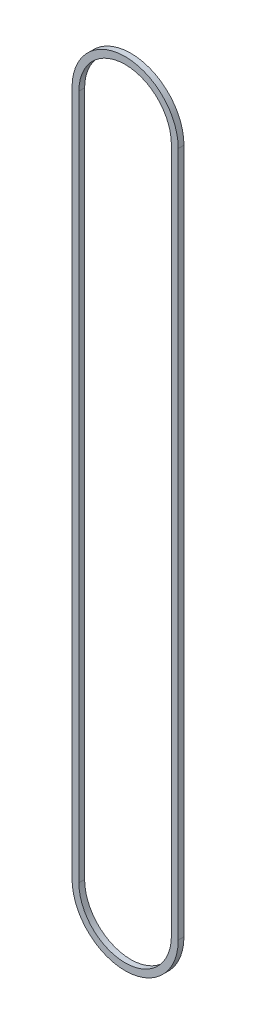
ISO-10303-21;
HEADER;
FILE_DESCRIPTION(('STEP AP214'),'2;1');
FILE_NAME('part.step','',(''),(''),'','','');
FILE_SCHEMA(('AUTOMOTIVE_DESIGN { 1 0 10303 214 1 1 1 1 }'));
ENDSEC;
DATA;
#1=APPLICATION_CONTEXT('core data for automotive mechanical design processes');
#2=APPLICATION_PROTOCOL_DEFINITION('international standard','automotive_design',2000,#1);
#3=PRODUCT_CONTEXT('',#1,'mechanical');
#4=PRODUCT('Part','Part','',(#3));
#5=PRODUCT_RELATED_PRODUCT_CATEGORY('part','',(#4));
#6=PRODUCT_DEFINITION_FORMATION('','',#4);
#7=PRODUCT_DEFINITION_CONTEXT('part definition',#1,'design');
#8=PRODUCT_DEFINITION('design','',#6,#7);
#9=PRODUCT_DEFINITION_SHAPE('','',#8);
#10=(LENGTH_UNIT() NAMED_UNIT(*) SI_UNIT(.MILLI.,.METRE.));
#11=(NAMED_UNIT(*) PLANE_ANGLE_UNIT() SI_UNIT($,.RADIAN.));
#12=(NAMED_UNIT(*) SI_UNIT($,.STERADIAN.) SOLID_ANGLE_UNIT());
#13=UNCERTAINTY_MEASURE_WITH_UNIT(LENGTH_MEASURE(1.E-05),#10,'distance_accuracy_value','');
#14=(GEOMETRIC_REPRESENTATION_CONTEXT(3) GLOBAL_UNCERTAINTY_ASSIGNED_CONTEXT((#13)) GLOBAL_UNIT_ASSIGNED_CONTEXT((#10,
#11,#12)) REPRESENTATION_CONTEXT('',''));
#15=CARTESIAN_POINT('',(0.,0.,0.));
#16=DIRECTION('',(0.,0.,1.));
#17=DIRECTION('',(1.,0.,0.));
#18=AXIS2_PLACEMENT_3D('',#15,#16,#17);
#19=CARTESIAN_POINT('',(0.,0.,6.35));
#20=DIRECTION('',(0.,0.,1.));
#21=DIRECTION('',(1.,0.,0.));
#22=AXIS2_PLACEMENT_3D('',#19,#20,#21);
#23=PLANE('',#22);
#24=CARTESIAN_POINT('',(0.,0.,6.35));
#25=DIRECTION('',(0.,0.,1.));
#26=DIRECTION('',(1.,0.,0.));
#27=AXIS2_PLACEMENT_3D('',#24,#25,#26);
#28=CIRCLE('',#27,59.0169);
#29=CARTESIAN_POINT('',(-59.0169,0.,6.35));
#30=VERTEX_POINT('',#29);
#31=CARTESIAN_POINT('',(59.0169,0.,6.35));
#32=VERTEX_POINT('',#31);
#33=EDGE_CURVE('E159',#30,#32,#28,.T.);
#34=ORIENTED_EDGE('',*,*,#33,.T.);
#35=DIRECTION('',(0.,1.,0.));
#36=VECTOR('',#35,1.);
#37=CARTESIAN_POINT('',(59.0169,0.,6.35));
#38=LINE('',#37,#36);
#39=CARTESIAN_POINT('',(59.0169,762.,6.35));
#40=VERTEX_POINT('',#39);
#41=EDGE_CURVE('E163',#32,#40,#38,.T.);
#42=ORIENTED_EDGE('',*,*,#41,.T.);
#43=CARTESIAN_POINT('',(0.,762.,6.35));
#44=DIRECTION('',(0.,0.,1.));
#45=DIRECTION('',(1.,0.,0.));
#46=AXIS2_PLACEMENT_3D('',#43,#44,#45);
#47=CIRCLE('',#46,59.0169);
#48=CARTESIAN_POINT('',(-59.0169,762.,6.35));
#49=VERTEX_POINT('',#48);
#50=EDGE_CURVE('E167',#40,#49,#47,.T.);
#51=ORIENTED_EDGE('',*,*,#50,.T.);
#52=DIRECTION('',(0.,-1.,0.));
#53=VECTOR('',#52,1.);
#54=CARTESIAN_POINT('',(-59.0169,0.,6.35));
#55=LINE('',#54,#53);
#56=EDGE_CURVE('E170',#49,#30,#55,.T.);
#57=ORIENTED_EDGE('',*,*,#56,.T.);
#58=EDGE_LOOP('',(#34,#42,#51,#57));
#59=FACE_BOUND('',#58,.T.);
#60=DIRECTION('',(0.,1.,0.));
#61=VECTOR('',#60,1.);
#62=CARTESIAN_POINT('',(51.3969,0.,6.35));
#63=LINE('',#62,#61);
#64=CARTESIAN_POINT('',(51.3969,0.,6.35));
#65=VERTEX_POINT('',#64);
#66=CARTESIAN_POINT('',(51.3969,762.,6.35));
#67=VERTEX_POINT('',#66);
#68=EDGE_CURVE('E120',#65,#67,#63,.T.);
#69=ORIENTED_EDGE('',*,*,#68,.F.);
#70=CARTESIAN_POINT('',(0.,0.,6.35));
#71=DIRECTION('',(0.,0.,1.));
#72=DIRECTION('',(1.,0.,0.));
#73=AXIS2_PLACEMENT_3D('',#70,#71,#72);
#74=CIRCLE('',#73,51.3969);
#75=CARTESIAN_POINT('',(-51.3969,0.,6.35));
#76=VERTEX_POINT('',#75);
#77=EDGE_CURVE('E111',#76,#65,#74,.T.);
#78=ORIENTED_EDGE('',*,*,#77,.F.);
#79=DIRECTION('',(0.,-1.,0.));
#80=VECTOR('',#79,1.);
#81=CARTESIAN_POINT('',(-51.3969,0.,6.35));
#82=LINE('',#81,#80);
#83=CARTESIAN_POINT('',(-51.3969,762.,6.35));
#84=VERTEX_POINT('',#83);
#85=EDGE_CURVE('E137',#84,#76,#82,.T.);
#86=ORIENTED_EDGE('',*,*,#85,.F.);
#87=CARTESIAN_POINT('',(0.,762.,6.35));
#88=DIRECTION('',(0.,0.,1.));
#89=DIRECTION('',(1.,0.,0.));
#90=AXIS2_PLACEMENT_3D('',#87,#88,#89);
#91=CIRCLE('',#90,51.3969);
#92=EDGE_CURVE('E133',#67,#84,#91,.T.);
#93=ORIENTED_EDGE('',*,*,#92,.F.);
#94=EDGE_LOOP('',(#69,#78,#86,#93));
#95=FACE_BOUND('',#94,.T.);
#96=ADVANCED_FACE('F45',(#59,#95),#23,.T.);
#97=CARTESIAN_POINT('',(0.,0.,0.));
#98=DIRECTION('',(0.,0.,1.));
#99=DIRECTION('',(1.,0.,0.));
#100=AXIS2_PLACEMENT_3D('',#97,#98,#99);
#101=PLANE('',#100);
#102=CARTESIAN_POINT('',(0.,0.,0.));
#103=DIRECTION('',(0.,0.,1.));
#104=DIRECTION('',(1.,0.,0.));
#105=AXIS2_PLACEMENT_3D('',#102,#103,#104);
#106=CIRCLE('',#105,59.0169);
#107=CARTESIAN_POINT('',(-59.0169,0.,0.));
#108=VERTEX_POINT('',#107);
#109=CARTESIAN_POINT('',(59.0169,0.,0.));
#110=VERTEX_POINT('',#109);
#111=EDGE_CURVE('E129',#108,#110,#106,.T.);
#112=ORIENTED_EDGE('',*,*,#111,.F.);
#113=DIRECTION('',(0.,-1.,0.));
#114=VECTOR('',#113,1.);
#115=CARTESIAN_POINT('',(-59.0169,0.,0.));
#116=LINE('',#115,#114);
#117=CARTESIAN_POINT('',(-59.0169,762.,0.));
#118=VERTEX_POINT('',#117);
#119=EDGE_CURVE('E164',#118,#108,#116,.T.);
#120=ORIENTED_EDGE('',*,*,#119,.F.);
#121=CARTESIAN_POINT('',(0.,762.,0.));
#122=DIRECTION('',(0.,0.,1.));
#123=DIRECTION('',(1.,0.,0.));
#124=AXIS2_PLACEMENT_3D('',#121,#122,#123);
#125=CIRCLE('',#124,59.0169);
#126=CARTESIAN_POINT('',(59.0169,762.,0.));
#127=VERTEX_POINT('',#126);
#128=EDGE_CURVE('E180',#127,#118,#125,.T.);
#129=ORIENTED_EDGE('',*,*,#128,.F.);
#130=DIRECTION('',(0.,1.,0.));
#131=VECTOR('',#130,1.);
#132=CARTESIAN_POINT('',(59.0169,0.,0.));
#133=LINE('',#132,#131);
#134=EDGE_CURVE('E177',#110,#127,#133,.T.);
#135=ORIENTED_EDGE('',*,*,#134,.F.);
#136=EDGE_LOOP('',(#112,#120,#129,#135));
#137=FACE_BOUND('',#136,.T.);
#138=CARTESIAN_POINT('',(0.,0.,0.));
#139=DIRECTION('',(0.,0.,1.));
#140=DIRECTION('',(1.,0.,0.));
#141=AXIS2_PLACEMENT_3D('',#138,#139,#140);
#142=CIRCLE('',#141,51.3969);
#143=CARTESIAN_POINT('',(-51.3969,0.,0.));
#144=VERTEX_POINT('',#143);
#145=CARTESIAN_POINT('',(51.3969,0.,0.));
#146=VERTEX_POINT('',#145);
#147=EDGE_CURVE('E69',#144,#146,#142,.T.);
#148=ORIENTED_EDGE('',*,*,#147,.T.);
#149=DIRECTION('',(0.,1.,0.));
#150=VECTOR('',#149,1.);
#151=CARTESIAN_POINT('',(51.3969,0.,0.));
#152=LINE('',#151,#150);
#153=CARTESIAN_POINT('',(51.3969,762.,0.));
#154=VERTEX_POINT('',#153);
#155=EDGE_CURVE('E127',#146,#154,#152,.T.);
#156=ORIENTED_EDGE('',*,*,#155,.T.);
#157=CARTESIAN_POINT('',(0.,762.,0.));
#158=DIRECTION('',(0.,0.,1.));
#159=DIRECTION('',(1.,0.,0.));
#160=AXIS2_PLACEMENT_3D('',#157,#158,#159);
#161=CIRCLE('',#160,51.3969);
#162=CARTESIAN_POINT('',(-51.3969,762.,0.));
#163=VERTEX_POINT('',#162);
#164=EDGE_CURVE('E146',#154,#163,#161,.T.);
#165=ORIENTED_EDGE('',*,*,#164,.T.);
#166=DIRECTION('',(0.,-1.,0.));
#167=VECTOR('',#166,1.);
#168=CARTESIAN_POINT('',(-51.3969,0.,0.));
#169=LINE('',#168,#167);
#170=EDGE_CURVE('E121',#163,#144,#169,.T.);
#171=ORIENTED_EDGE('',*,*,#170,.T.);
#172=EDGE_LOOP('',(#148,#156,#165,#171));
#173=FACE_BOUND('',#172,.T.);
#174=ADVANCED_FACE('F203',(#137,#173),#101,.F.);
#175=CARTESIAN_POINT('',(0.,0.,6.35));
#176=DIRECTION('',(0.,0.,-1.));
#177=DIRECTION('',(-1.,0.,0.));
#178=AXIS2_PLACEMENT_3D('',#175,#176,#177);
#179=CYLINDRICAL_SURFACE('',#178,59.0169);
#180=ORIENTED_EDGE('',*,*,#111,.T.);
#181=DIRECTION('',(0.,0.,-1.));
#182=VECTOR('',#181,1.);
#183=CARTESIAN_POINT('',(59.0169,0.,6.35));
#184=LINE('',#183,#182);
#185=EDGE_CURVE('E11',#32,#110,#184,.T.);
#186=ORIENTED_EDGE('',*,*,#185,.F.);
#187=ORIENTED_EDGE('',*,*,#33,.F.);
#188=DIRECTION('',(0.,0.,-1.));
#189=VECTOR('',#188,1.);
#190=CARTESIAN_POINT('',(-59.0169,0.,6.35));
#191=LINE('',#190,#189);
#192=EDGE_CURVE('E173',#30,#108,#191,.T.);
#193=ORIENTED_EDGE('',*,*,#192,.T.);
#194=EDGE_LOOP('',(#180,#186,#187,#193));
#195=FACE_BOUND('',#194,.T.);
#196=ADVANCED_FACE('F47',(#195),#179,.T.);
#197=CARTESIAN_POINT('',(59.0169,0.,6.35));
#198=DIRECTION('',(-1.,0.,0.));
#199=DIRECTION('',(0.,0.,1.));
#200=AXIS2_PLACEMENT_3D('',#197,#198,#199);
#201=PLANE('',#200);
#202=ORIENTED_EDGE('',*,*,#134,.T.);
#203=DIRECTION('',(0.,0.,-1.));
#204=VECTOR('',#203,1.);
#205=CARTESIAN_POINT('',(59.0169,762.,6.35));
#206=LINE('',#205,#204);
#207=EDGE_CURVE('E54',#40,#127,#206,.T.);
#208=ORIENTED_EDGE('',*,*,#207,.F.);
#209=ORIENTED_EDGE('',*,*,#41,.F.);
#210=ORIENTED_EDGE('',*,*,#185,.T.);
#211=EDGE_LOOP('',(#202,#208,#209,#210));
#212=FACE_BOUND('',#211,.T.);
#213=ADVANCED_FACE('F213',(#212),#201,.F.);
#214=CARTESIAN_POINT('',(0.,762.,6.35));
#215=DIRECTION('',(0.,0.,-1.));
#216=DIRECTION('',(-1.,0.,0.));
#217=AXIS2_PLACEMENT_3D('',#214,#215,#216);
#218=CYLINDRICAL_SURFACE('',#217,59.0169);
#219=ORIENTED_EDGE('',*,*,#128,.T.);
#220=DIRECTION('',(0.,0.,-1.));
#221=VECTOR('',#220,1.);
#222=CARTESIAN_POINT('',(-59.0169,762.,6.35));
#223=LINE('',#222,#221);
#224=EDGE_CURVE('E188',#49,#118,#223,.T.);
#225=ORIENTED_EDGE('',*,*,#224,.F.);
#226=ORIENTED_EDGE('',*,*,#50,.F.);
#227=ORIENTED_EDGE('',*,*,#207,.T.);
#228=EDGE_LOOP('',(#219,#225,#226,#227));
#229=FACE_BOUND('',#228,.T.);
#230=ADVANCED_FACE('F197',(#229),#218,.T.);
#231=CARTESIAN_POINT('',(-59.0169,0.,6.35));
#232=DIRECTION('',(1.,0.,0.));
#233=DIRECTION('',(0.,0.,-1.));
#234=AXIS2_PLACEMENT_3D('',#231,#232,#233);
#235=PLANE('',#234);
#236=ORIENTED_EDGE('',*,*,#119,.T.);
#237=ORIENTED_EDGE('',*,*,#192,.F.);
#238=ORIENTED_EDGE('',*,*,#56,.F.);
#239=ORIENTED_EDGE('',*,*,#224,.T.);
#240=EDGE_LOOP('',(#236,#237,#238,#239));
#241=FACE_BOUND('',#240,.T.);
#242=ADVANCED_FACE('F207',(#241),#235,.F.);
#243=CARTESIAN_POINT('',(0.,0.,6.35));
#244=DIRECTION('',(0.,0.,-1.));
#245=DIRECTION('',(-1.,0.,0.));
#246=AXIS2_PLACEMENT_3D('',#243,#244,#245);
#247=CYLINDRICAL_SURFACE('',#246,51.3969);
#248=ORIENTED_EDGE('',*,*,#147,.F.);
#249=DIRECTION('',(0.,0.,-1.));
#250=VECTOR('',#249,1.);
#251=CARTESIAN_POINT('',(-51.3969,0.,6.35));
#252=LINE('',#251,#250);
#253=EDGE_CURVE('E115',#76,#144,#252,.T.);
#254=ORIENTED_EDGE('',*,*,#253,.F.);
#255=ORIENTED_EDGE('',*,*,#77,.T.);
#256=DIRECTION('',(0.,0.,-1.));
#257=VECTOR('',#256,1.);
#258=CARTESIAN_POINT('',(51.3969,0.,6.35));
#259=LINE('',#258,#257);
#260=EDGE_CURVE('E114',#65,#146,#259,.T.);
#261=ORIENTED_EDGE('',*,*,#260,.T.);
#262=EDGE_LOOP('',(#248,#254,#255,#261));
#263=FACE_BOUND('',#262,.T.);
#264=ADVANCED_FACE('F113',(#263),#247,.F.);
#265=CARTESIAN_POINT('',(51.3969,0.,6.35));
#266=DIRECTION('',(-1.,0.,0.));
#267=DIRECTION('',(0.,0.,1.));
#268=AXIS2_PLACEMENT_3D('',#265,#266,#267);
#269=PLANE('',#268);
#270=ORIENTED_EDGE('',*,*,#155,.F.);
#271=ORIENTED_EDGE('',*,*,#260,.F.);
#272=ORIENTED_EDGE('',*,*,#68,.T.);
#273=DIRECTION('',(0.,0.,-1.));
#274=VECTOR('',#273,1.);
#275=CARTESIAN_POINT('',(51.3969,762.,6.35));
#276=LINE('',#275,#274);
#277=EDGE_CURVE('E130',#67,#154,#276,.T.);
#278=ORIENTED_EDGE('',*,*,#277,.T.);
#279=EDGE_LOOP('',(#270,#271,#272,#278));
#280=FACE_BOUND('',#279,.T.);
#281=ADVANCED_FACE('F124',(#280),#269,.T.);
#282=CARTESIAN_POINT('',(0.,762.,6.35));
#283=DIRECTION('',(0.,0.,-1.));
#284=DIRECTION('',(-1.,0.,0.));
#285=AXIS2_PLACEMENT_3D('',#282,#283,#284);
#286=CYLINDRICAL_SURFACE('',#285,51.3969);
#287=ORIENTED_EDGE('',*,*,#164,.F.);
#288=ORIENTED_EDGE('',*,*,#277,.F.);
#289=ORIENTED_EDGE('',*,*,#92,.T.);
#290=DIRECTION('',(0.,0.,-1.));
#291=VECTOR('',#290,1.);
#292=CARTESIAN_POINT('',(-51.3969,762.,6.35));
#293=LINE('',#292,#291);
#294=EDGE_CURVE('E61',#84,#163,#293,.T.);
#295=ORIENTED_EDGE('',*,*,#294,.T.);
#296=EDGE_LOOP('',(#287,#288,#289,#295));
#297=FACE_BOUND('',#296,.T.);
#298=ADVANCED_FACE('F236',(#297),#286,.F.);
#299=CARTESIAN_POINT('',(-51.3969,0.,6.35));
#300=DIRECTION('',(1.,0.,0.));
#301=DIRECTION('',(0.,0.,-1.));
#302=AXIS2_PLACEMENT_3D('',#299,#300,#301);
#303=PLANE('',#302);
#304=ORIENTED_EDGE('',*,*,#170,.F.);
#305=ORIENTED_EDGE('',*,*,#294,.F.);
#306=ORIENTED_EDGE('',*,*,#85,.T.);
#307=ORIENTED_EDGE('',*,*,#253,.T.);
#308=EDGE_LOOP('',(#304,#305,#306,#307));
#309=FACE_BOUND('',#308,.T.);
#310=ADVANCED_FACE('F240',(#309),#303,.T.);
#311=CLOSED_SHELL('',(#96,#174,#196,#213,#230,#242,#264,#281,#298,#310));
#312=MANIFOLD_SOLID_BREP('B2',#311);
#313=ADVANCED_BREP_SHAPE_REPRESENTATION('',(#18,#312),#14);
#314=SHAPE_DEFINITION_REPRESENTATION(#9,#313);
ENDSEC;
END-ISO-10303-21;
